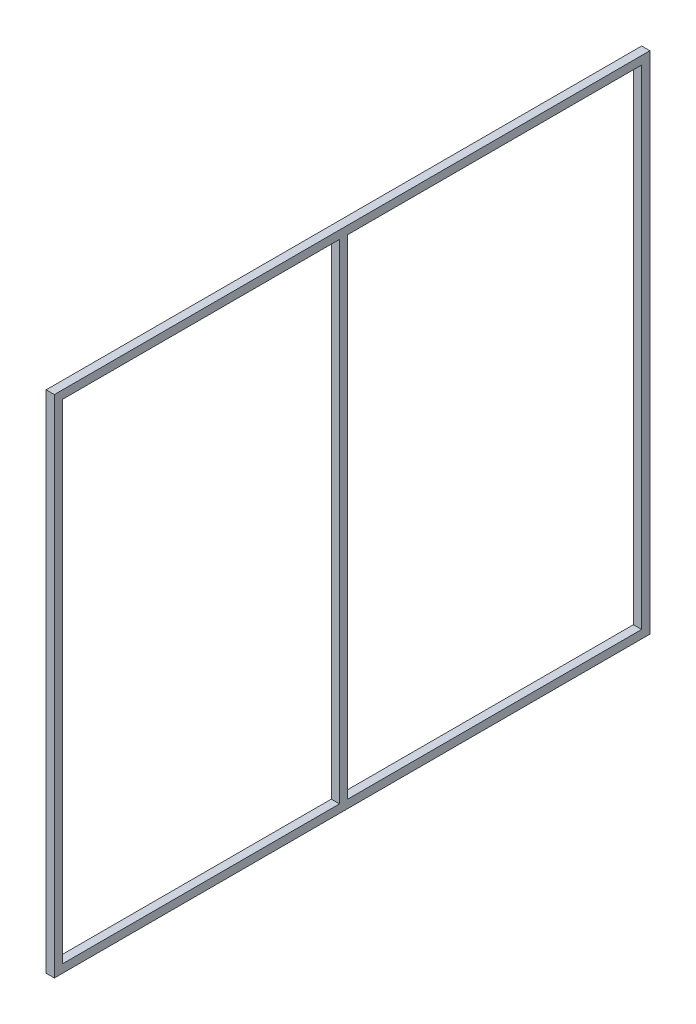
ISO-10303-21;
HEADER;
FILE_DESCRIPTION(('STEP AP214'),'2;1');
FILE_NAME('part.step','',(''),(''),'','','');
FILE_SCHEMA(('AUTOMOTIVE_DESIGN { 1 0 10303 214 1 1 1 1 }'));
ENDSEC;
DATA;
#1=APPLICATION_CONTEXT('core data for automotive mechanical design processes');
#2=APPLICATION_PROTOCOL_DEFINITION('international standard','automotive_design',2000,#1);
#3=PRODUCT_CONTEXT('',#1,'mechanical');
#4=PRODUCT('Part','Part','',(#3));
#5=PRODUCT_RELATED_PRODUCT_CATEGORY('part','',(#4));
#6=PRODUCT_DEFINITION_FORMATION('','',#4);
#7=PRODUCT_DEFINITION_CONTEXT('part definition',#1,'design');
#8=PRODUCT_DEFINITION('design','',#6,#7);
#9=PRODUCT_DEFINITION_SHAPE('','',#8);
#10=(LENGTH_UNIT() NAMED_UNIT(*) SI_UNIT(.MILLI.,.METRE.));
#11=(NAMED_UNIT(*) PLANE_ANGLE_UNIT() SI_UNIT($,.RADIAN.));
#12=(NAMED_UNIT(*) SI_UNIT($,.STERADIAN.) SOLID_ANGLE_UNIT());
#13=UNCERTAINTY_MEASURE_WITH_UNIT(LENGTH_MEASURE(1.E-05),#10,'distance_accuracy_value','');
#14=(GEOMETRIC_REPRESENTATION_CONTEXT(3) GLOBAL_UNCERTAINTY_ASSIGNED_CONTEXT((#13)) GLOBAL_UNIT_ASSIGNED_CONTEXT((#10,
#11,#12)) REPRESENTATION_CONTEXT('',''));
#15=CARTESIAN_POINT('',(0.,0.,0.));
#16=DIRECTION('',(0.,0.,1.));
#17=DIRECTION('',(1.,0.,0.));
#18=AXIS2_PLACEMENT_3D('',#15,#16,#17);
#19=CARTESIAN_POINT('',(15.875,-472.0175,-559.125));
#20=DIRECTION('',(0.,1.,0.));
#21=DIRECTION('',(0.,0.,-1.));
#22=AXIS2_PLACEMENT_3D('',#19,#20,#21);
#23=PLANE('',#22);
#24=DIRECTION('',(0.,0.,1.));
#25=VECTOR('',#24,1.);
#26=CARTESIAN_POINT('',(15.875,-472.0175,-559.125));
#27=LINE('',#26,#25);
#28=CARTESIAN_POINT('',(15.875,-472.0175,-559.125));
#29=VERTEX_POINT('',#28);
#30=CARTESIAN_POINT('',(15.875,-472.0175,8.43750000000501));
#31=VERTEX_POINT('',#30);
#32=EDGE_CURVE('E147',#29,#31,#27,.T.);
#33=ORIENTED_EDGE('',*,*,#32,.F.);
#34=DIRECTION('',(-1.,0.,0.));
#35=VECTOR('',#34,1.);
#36=CARTESIAN_POINT('',(15.875,-472.0175,-559.125));
#37=LINE('',#36,#35);
#38=CARTESIAN_POINT('',(0.,-472.0175,-559.125));
#39=VERTEX_POINT('',#38);
#40=EDGE_CURVE('E163',#29,#39,#37,.T.);
#41=ORIENTED_EDGE('',*,*,#40,.T.);
#42=DIRECTION('',(0.,0.,1.));
#43=VECTOR('',#42,1.);
#44=CARTESIAN_POINT('',(0.,-472.0175,-559.125));
#45=LINE('',#44,#43);
#46=CARTESIAN_POINT('',(0.,-472.0175,8.43750000000498));
#47=VERTEX_POINT('',#46);
#48=EDGE_CURVE('E164',#39,#47,#45,.T.);
#49=ORIENTED_EDGE('',*,*,#48,.T.);
#50=DIRECTION('',(1.,0.,0.));
#51=VECTOR('',#50,1.);
#52=CARTESIAN_POINT('',(15.875,-472.0175,8.43750000000501));
#53=LINE('',#52,#51);
#54=EDGE_CURVE('E142',#47,#31,#53,.T.);
#55=ORIENTED_EDGE('',*,*,#54,.T.);
#56=EDGE_LOOP('',(#33,#41,#49,#55));
#57=FACE_BOUND('',#56,.T.);
#58=ADVANCED_FACE('F35',(#57),#23,.T.);
#59=CARTESIAN_POINT('',(0.,-472.0175,24.312500000005));
#60=VERTEX_POINT('',#59);
#61=CARTESIAN_POINT('',(0.,-472.0175,559.125));
#62=VERTEX_POINT('',#61);
#63=EDGE_CURVE('E168',#60,#62,#45,.T.);
#64=ORIENTED_EDGE('',*,*,#63,.T.);
#65=DIRECTION('',(-1.,0.,0.));
#66=VECTOR('',#65,1.);
#67=CARTESIAN_POINT('',(15.875,-472.0175,559.125));
#68=LINE('',#67,#66);
#69=CARTESIAN_POINT('',(15.875,-472.0175,559.125));
#70=VERTEX_POINT('',#69);
#71=EDGE_CURVE('E146',#70,#62,#68,.T.);
#72=ORIENTED_EDGE('',*,*,#71,.F.);
#73=CARTESIAN_POINT('',(15.875,-472.0175,24.3125000000051));
#74=VERTEX_POINT('',#73);
#75=EDGE_CURVE('E129',#74,#70,#27,.T.);
#76=ORIENTED_EDGE('',*,*,#75,.F.);
#77=DIRECTION('',(-1.,0.,0.));
#78=VECTOR('',#77,1.);
#79=CARTESIAN_POINT('',(15.875,-472.0175,24.3125000000051));
#80=LINE('',#79,#78);
#81=EDGE_CURVE('E136',#74,#60,#80,.T.);
#82=ORIENTED_EDGE('',*,*,#81,.T.);
#83=EDGE_LOOP('',(#64,#72,#76,#82));
#84=FACE_BOUND('',#83,.T.);
#85=ADVANCED_FACE('F144',(#84),#23,.T.);
#86=CARTESIAN_POINT('',(15.875,472.0175,-559.125));
#87=DIRECTION('',(0.,-1.,0.));
#88=DIRECTION('',(0.,0.,1.));
#89=AXIS2_PLACEMENT_3D('',#86,#87,#88);
#90=PLANE('',#89);
#91=DIRECTION('',(0.,0.,-1.));
#92=VECTOR('',#91,1.);
#93=CARTESIAN_POINT('',(0.,472.0175,-559.125));
#94=LINE('',#93,#92);
#95=CARTESIAN_POINT('',(0.,472.0175,8.43750000000498));
#96=VERTEX_POINT('',#95);
#97=CARTESIAN_POINT('',(0.,472.0175,-559.125));
#98=VERTEX_POINT('',#97);
#99=EDGE_CURVE('E170',#96,#98,#94,.T.);
#100=ORIENTED_EDGE('',*,*,#99,.T.);
#101=DIRECTION('',(-1.,0.,0.));
#102=VECTOR('',#101,1.);
#103=CARTESIAN_POINT('',(15.875,472.0175,-559.125));
#104=LINE('',#103,#102);
#105=CARTESIAN_POINT('',(15.875,472.0175,-559.125));
#106=VERTEX_POINT('',#105);
#107=EDGE_CURVE('E175',#106,#98,#104,.T.);
#108=ORIENTED_EDGE('',*,*,#107,.F.);
#109=DIRECTION('',(0.,0.,-1.));
#110=VECTOR('',#109,1.);
#111=CARTESIAN_POINT('',(15.875,472.0175,-559.125));
#112=LINE('',#111,#110);
#113=CARTESIAN_POINT('',(15.875,472.0175,8.43750000000501));
#114=VERTEX_POINT('',#113);
#115=EDGE_CURVE('E159',#114,#106,#112,.T.);
#116=ORIENTED_EDGE('',*,*,#115,.F.);
#117=DIRECTION('',(-1.,0.,0.));
#118=VECTOR('',#117,1.);
#119=CARTESIAN_POINT('',(15.875,472.0175,8.43750000000501));
#120=LINE('',#119,#118);
#121=EDGE_CURVE('E134',#114,#96,#120,.T.);
#122=ORIENTED_EDGE('',*,*,#121,.T.);
#123=EDGE_LOOP('',(#100,#108,#116,#122));
#124=FACE_BOUND('',#123,.T.);
#125=ADVANCED_FACE('F246',(#124),#90,.T.);
#126=CARTESIAN_POINT('',(15.875,472.0175,559.125));
#127=VERTEX_POINT('',#126);
#128=CARTESIAN_POINT('',(15.875,472.0175,24.3125000000051));
#129=VERTEX_POINT('',#128);
#130=EDGE_CURVE('E132',#127,#129,#112,.T.);
#131=ORIENTED_EDGE('',*,*,#130,.F.);
#132=DIRECTION('',(-1.,0.,0.));
#133=VECTOR('',#132,1.);
#134=CARTESIAN_POINT('',(15.875,472.0175,559.125));
#135=LINE('',#134,#133);
#136=CARTESIAN_POINT('',(0.,472.0175,559.125));
#137=VERTEX_POINT('',#136);
#138=EDGE_CURVE('E178',#127,#137,#135,.T.);
#139=ORIENTED_EDGE('',*,*,#138,.T.);
#140=CARTESIAN_POINT('',(0.,472.0175,24.312500000005));
#141=VERTEX_POINT('',#140);
#142=EDGE_CURVE('E152',#137,#141,#94,.T.);
#143=ORIENTED_EDGE('',*,*,#142,.T.);
#144=DIRECTION('',(1.,0.,0.));
#145=VECTOR('',#144,1.);
#146=CARTESIAN_POINT('',(15.875,472.0175,24.3125000000051));
#147=LINE('',#146,#145);
#148=EDGE_CURVE('E156',#141,#129,#147,.T.);
#149=ORIENTED_EDGE('',*,*,#148,.T.);
#150=EDGE_LOOP('',(#131,#139,#143,#149));
#151=FACE_BOUND('',#150,.T.);
#152=ADVANCED_FACE('F251',(#151),#90,.T.);
#153=CARTESIAN_POINT('',(15.875,0.,0.));
#154=DIRECTION('',(-1.,0.,0.));
#155=DIRECTION('',(0.,0.,-1.));
#156=AXIS2_PLACEMENT_3D('',#153,#154,#155);
#157=PLANE('',#156);
#158=ORIENTED_EDGE('',*,*,#75,.T.);
#159=DIRECTION('',(0.,1.,0.));
#160=VECTOR('',#159,1.);
#161=CARTESIAN_POINT('',(15.875,-472.0175,559.125));
#162=LINE('',#161,#160);
#163=EDGE_CURVE('E151',#70,#127,#162,.T.);
#164=ORIENTED_EDGE('',*,*,#163,.T.);
#165=ORIENTED_EDGE('',*,*,#130,.T.);
#166=DIRECTION('',(0.,-1.,0.));
#167=VECTOR('',#166,1.);
#168=CARTESIAN_POINT('',(15.875,487.8945,24.3125000000051));
#169=LINE('',#168,#167);
#170=EDGE_CURVE('E125',#129,#74,#169,.T.);
#171=ORIENTED_EDGE('',*,*,#170,.T.);
#172=EDGE_LOOP('',(#158,#164,#165,#171));
#173=FACE_BOUND('',#172,.T.);
#174=DIRECTION('',(0.,1.,0.));
#175=VECTOR('',#174,1.);
#176=CARTESIAN_POINT('',(15.875,-487.8925,575.));
#177=LINE('',#176,#175);
#178=CARTESIAN_POINT('',(15.875,-487.8925,575.));
#179=VERTEX_POINT('',#178);
#180=CARTESIAN_POINT('',(15.875,487.8925,575.));
#181=VERTEX_POINT('',#180);
#182=EDGE_CURVE('E183',#179,#181,#177,.T.);
#183=ORIENTED_EDGE('',*,*,#182,.F.);
#184=DIRECTION('',(0.,0.,1.));
#185=VECTOR('',#184,1.);
#186=CARTESIAN_POINT('',(15.875,-487.8925,-575.));
#187=LINE('',#186,#185);
#188=CARTESIAN_POINT('',(15.875,-487.8925,-575.));
#189=VERTEX_POINT('',#188);
#190=EDGE_CURVE('E193',#189,#179,#187,.T.);
#191=ORIENTED_EDGE('',*,*,#190,.F.);
#192=DIRECTION('',(0.,-1.,0.));
#193=VECTOR('',#192,1.);
#194=CARTESIAN_POINT('',(15.875,-487.8925,-575.));
#195=LINE('',#194,#193);
#196=CARTESIAN_POINT('',(15.875,487.8925,-575.));
#197=VERTEX_POINT('',#196);
#198=EDGE_CURVE('E190',#197,#189,#195,.T.);
#199=ORIENTED_EDGE('',*,*,#198,.F.);
#200=DIRECTION('',(0.,0.,-1.));
#201=VECTOR('',#200,1.);
#202=CARTESIAN_POINT('',(15.875,487.8925,-575.));
#203=LINE('',#202,#201);
#204=EDGE_CURVE('E186',#181,#197,#203,.T.);
#205=ORIENTED_EDGE('',*,*,#204,.F.);
#206=EDGE_LOOP('',(#183,#191,#199,#205));
#207=FACE_BOUND('',#206,.T.);
#208=ORIENTED_EDGE('',*,*,#32,.T.);
#209=DIRECTION('',(0.,-1.,0.));
#210=VECTOR('',#209,1.);
#211=CARTESIAN_POINT('',(15.875,487.8945,8.43750000000501));
#212=LINE('',#211,#210);
#213=EDGE_CURVE('E141',#114,#31,#212,.T.);
#214=ORIENTED_EDGE('',*,*,#213,.F.);
#215=ORIENTED_EDGE('',*,*,#115,.T.);
#216=DIRECTION('',(0.,-1.,0.));
#217=VECTOR('',#216,1.);
#218=CARTESIAN_POINT('',(15.875,-472.0175,-559.125));
#219=LINE('',#218,#217);
#220=EDGE_CURVE('E161',#106,#29,#219,.T.);
#221=ORIENTED_EDGE('',*,*,#220,.T.);
#222=EDGE_LOOP('',(#208,#214,#215,#221));
#223=FACE_BOUND('',#222,.T.);
#224=ADVANCED_FACE('F126',(#173,#207,#223),#157,.F.);
#225=CARTESIAN_POINT('',(0.,0.,0.));
#226=DIRECTION('',(-1.,0.,0.));
#227=DIRECTION('',(0.,0.,-1.));
#228=AXIS2_PLACEMENT_3D('',#225,#226,#227);
#229=PLANE('',#228);
#230=ORIENTED_EDGE('',*,*,#48,.F.);
#231=DIRECTION('',(0.,-1.,0.));
#232=VECTOR('',#231,1.);
#233=CARTESIAN_POINT('',(0.,-472.0175,-559.125));
#234=LINE('',#233,#232);
#235=EDGE_CURVE('E148',#98,#39,#234,.T.);
#236=ORIENTED_EDGE('',*,*,#235,.F.);
#237=ORIENTED_EDGE('',*,*,#99,.F.);
#238=DIRECTION('',(0.,-1.,0.));
#239=VECTOR('',#238,1.);
#240=CARTESIAN_POINT('',(0.,487.8945,8.43750000000498));
#241=LINE('',#240,#239);
#242=EDGE_CURVE('E58',#96,#47,#241,.T.);
#243=ORIENTED_EDGE('',*,*,#242,.T.);
#244=EDGE_LOOP('',(#230,#236,#237,#243));
#245=FACE_BOUND('',#244,.T.);
#246=DIRECTION('',(0.,1.,0.));
#247=VECTOR('',#246,1.);
#248=CARTESIAN_POINT('',(0.,-487.8925,575.));
#249=LINE('',#248,#247);
#250=CARTESIAN_POINT('',(0.,-487.8925,575.));
#251=VERTEX_POINT('',#250);
#252=CARTESIAN_POINT('',(0.,487.8925,575.));
#253=VERTEX_POINT('',#252);
#254=EDGE_CURVE('E182',#251,#253,#249,.T.);
#255=ORIENTED_EDGE('',*,*,#254,.T.);
#256=DIRECTION('',(0.,0.,-1.));
#257=VECTOR('',#256,1.);
#258=CARTESIAN_POINT('',(0.,487.8925,-575.));
#259=LINE('',#258,#257);
#260=CARTESIAN_POINT('',(0.,487.8925,-575.));
#261=VERTEX_POINT('',#260);
#262=EDGE_CURVE('E199',#253,#261,#259,.T.);
#263=ORIENTED_EDGE('',*,*,#262,.T.);
#264=DIRECTION('',(0.,-1.,0.));
#265=VECTOR('',#264,1.);
#266=CARTESIAN_POINT('',(0.,-487.8925,-575.));
#267=LINE('',#266,#265);
#268=CARTESIAN_POINT('',(0.,-487.8925,-575.));
#269=VERTEX_POINT('',#268);
#270=EDGE_CURVE('E202',#261,#269,#267,.T.);
#271=ORIENTED_EDGE('',*,*,#270,.T.);
#272=DIRECTION('',(0.,0.,1.));
#273=VECTOR('',#272,1.);
#274=CARTESIAN_POINT('',(0.,-487.8925,559.125));
#275=LINE('',#274,#273);
#276=EDGE_CURVE('E187',#269,#251,#275,.T.);
#277=ORIENTED_EDGE('',*,*,#276,.T.);
#278=EDGE_LOOP('',(#255,#263,#271,#277));
#279=FACE_BOUND('',#278,.T.);
#280=DIRECTION('',(0.,-1.,0.));
#281=VECTOR('',#280,1.);
#282=CARTESIAN_POINT('',(0.,487.8945,24.312500000005));
#283=LINE('',#282,#281);
#284=EDGE_CURVE('E50',#141,#60,#283,.T.);
#285=ORIENTED_EDGE('',*,*,#284,.F.);
#286=ORIENTED_EDGE('',*,*,#142,.F.);
#287=DIRECTION('',(0.,1.,0.));
#288=VECTOR('',#287,1.);
#289=CARTESIAN_POINT('',(0.,-472.0175,559.125));
#290=LINE('',#289,#288);
#291=EDGE_CURVE('E167',#62,#137,#290,.T.);
#292=ORIENTED_EDGE('',*,*,#291,.F.);
#293=ORIENTED_EDGE('',*,*,#63,.F.);
#294=EDGE_LOOP('',(#285,#286,#292,#293));
#295=FACE_BOUND('',#294,.T.);
#296=ADVANCED_FACE('F219',(#245,#279,#295),#229,.T.);
#297=CARTESIAN_POINT('',(15.875,-487.8925,575.));
#298=DIRECTION('',(0.,0.,-1.));
#299=DIRECTION('',(1.,0.,0.));
#300=AXIS2_PLACEMENT_3D('',#297,#298,#299);
#301=PLANE('',#300);
#302=ORIENTED_EDGE('',*,*,#254,.F.);
#303=DIRECTION('',(-1.,0.,0.));
#304=VECTOR('',#303,1.);
#305=CARTESIAN_POINT('',(15.875,-487.8925,575.));
#306=LINE('',#305,#304);
#307=EDGE_CURVE('E196',#179,#251,#306,.T.);
#308=ORIENTED_EDGE('',*,*,#307,.F.);
#309=ORIENTED_EDGE('',*,*,#182,.T.);
#310=DIRECTION('',(-1.,0.,0.));
#311=VECTOR('',#310,1.);
#312=CARTESIAN_POINT('',(15.875,487.8925,575.));
#313=LINE('',#312,#311);
#314=EDGE_CURVE('E11',#181,#253,#313,.T.);
#315=ORIENTED_EDGE('',*,*,#314,.T.);
#316=EDGE_LOOP('',(#302,#308,#309,#315));
#317=FACE_BOUND('',#316,.T.);
#318=ADVANCED_FACE('F37',(#317),#301,.F.);
#319=CARTESIAN_POINT('',(15.875,487.8925,-575.));
#320=DIRECTION('',(0.,-1.,0.));
#321=DIRECTION('',(0.,0.,1.));
#322=AXIS2_PLACEMENT_3D('',#319,#320,#321);
#323=PLANE('',#322);
#324=ORIENTED_EDGE('',*,*,#262,.F.);
#325=ORIENTED_EDGE('',*,*,#314,.F.);
#326=ORIENTED_EDGE('',*,*,#204,.T.);
#327=DIRECTION('',(-1.,0.,0.));
#328=VECTOR('',#327,1.);
#329=CARTESIAN_POINT('',(15.875,487.8925,-575.));
#330=LINE('',#329,#328);
#331=EDGE_CURVE('E43',#197,#261,#330,.T.);
#332=ORIENTED_EDGE('',*,*,#331,.T.);
#333=EDGE_LOOP('',(#324,#325,#326,#332));
#334=FACE_BOUND('',#333,.T.);
#335=ADVANCED_FACE('F212',(#334),#323,.F.);
#336=CARTESIAN_POINT('',(15.875,-487.8925,-575.));
#337=DIRECTION('',(0.,0.,1.));
#338=DIRECTION('',(-1.,0.,0.));
#339=AXIS2_PLACEMENT_3D('',#336,#337,#338);
#340=PLANE('',#339);
#341=ORIENTED_EDGE('',*,*,#270,.F.);
#342=ORIENTED_EDGE('',*,*,#331,.F.);
#343=ORIENTED_EDGE('',*,*,#198,.T.);
#344=DIRECTION('',(-1.,0.,0.));
#345=VECTOR('',#344,1.);
#346=CARTESIAN_POINT('',(15.875,-487.8925,-575.));
#347=LINE('',#346,#345);
#348=EDGE_CURVE('E208',#189,#269,#347,.T.);
#349=ORIENTED_EDGE('',*,*,#348,.T.);
#350=EDGE_LOOP('',(#341,#342,#343,#349));
#351=FACE_BOUND('',#350,.T.);
#352=ADVANCED_FACE('F216',(#351),#340,.F.);
#353=CARTESIAN_POINT('',(15.875,-487.8925,559.125));
#354=DIRECTION('',(0.,1.,0.));
#355=DIRECTION('',(0.,0.,-1.));
#356=AXIS2_PLACEMENT_3D('',#353,#354,#355);
#357=PLANE('',#356);
#358=ORIENTED_EDGE('',*,*,#276,.F.);
#359=ORIENTED_EDGE('',*,*,#348,.F.);
#360=ORIENTED_EDGE('',*,*,#190,.T.);
#361=ORIENTED_EDGE('',*,*,#307,.T.);
#362=EDGE_LOOP('',(#358,#359,#360,#361));
#363=FACE_BOUND('',#362,.T.);
#364=ADVANCED_FACE('F227',(#363),#357,.F.);
#365=CARTESIAN_POINT('',(15.875,-472.0175,559.125));
#366=DIRECTION('',(0.,0.,-1.));
#367=DIRECTION('',(1.,0.,0.));
#368=AXIS2_PLACEMENT_3D('',#365,#366,#367);
#369=PLANE('',#368);
#370=ORIENTED_EDGE('',*,*,#291,.T.);
#371=ORIENTED_EDGE('',*,*,#138,.F.);
#372=ORIENTED_EDGE('',*,*,#163,.F.);
#373=ORIENTED_EDGE('',*,*,#71,.T.);
#374=EDGE_LOOP('',(#370,#371,#372,#373));
#375=FACE_BOUND('',#374,.T.);
#376=ADVANCED_FACE('F229',(#375),#369,.T.);
#377=CARTESIAN_POINT('',(15.875,-472.0175,-559.125));
#378=DIRECTION('',(0.,0.,1.));
#379=DIRECTION('',(0.,1.,0.));
#380=AXIS2_PLACEMENT_3D('',#377,#378,#379);
#381=PLANE('',#380);
#382=ORIENTED_EDGE('',*,*,#235,.T.);
#383=ORIENTED_EDGE('',*,*,#40,.F.);
#384=ORIENTED_EDGE('',*,*,#220,.F.);
#385=ORIENTED_EDGE('',*,*,#107,.T.);
#386=EDGE_LOOP('',(#382,#383,#384,#385));
#387=FACE_BOUND('',#386,.T.);
#388=ADVANCED_FACE('F235',(#387),#381,.T.);
#389=CARTESIAN_POINT('',(15.875,487.8945,8.43750000000501));
#390=DIRECTION('',(0.,0.,1.));
#391=DIRECTION('',(-1.,0.,0.));
#392=AXIS2_PLACEMENT_3D('',#389,#390,#391);
#393=PLANE('',#392);
#394=ORIENTED_EDGE('',*,*,#213,.T.);
#395=ORIENTED_EDGE('',*,*,#54,.F.);
#396=ORIENTED_EDGE('',*,*,#242,.F.);
#397=ORIENTED_EDGE('',*,*,#121,.F.);
#398=EDGE_LOOP('',(#394,#395,#396,#397));
#399=FACE_BOUND('',#398,.T.);
#400=ADVANCED_FACE('F271',(#399),#393,.F.);
#401=CARTESIAN_POINT('',(15.875,487.8945,24.3125000000051));
#402=DIRECTION('',(0.,0.,-1.));
#403=DIRECTION('',(1.,0.,0.));
#404=AXIS2_PLACEMENT_3D('',#401,#402,#403);
#405=PLANE('',#404);
#406=ORIENTED_EDGE('',*,*,#284,.T.);
#407=ORIENTED_EDGE('',*,*,#81,.F.);
#408=ORIENTED_EDGE('',*,*,#170,.F.);
#409=ORIENTED_EDGE('',*,*,#148,.F.);
#410=EDGE_LOOP('',(#406,#407,#408,#409));
#411=FACE_BOUND('',#410,.T.);
#412=ADVANCED_FACE('F137',(#411),#405,.F.);
#413=CLOSED_SHELL('',(#58,#85,#125,#152,#224,#296,#318,#335,#352,#364,#376,#388,#400,#412));
#414=MANIFOLD_SOLID_BREP('B2',#413);
#415=ADVANCED_BREP_SHAPE_REPRESENTATION('',(#18,#414),#14);
#416=SHAPE_DEFINITION_REPRESENTATION(#9,#415);
ENDSEC;
END-ISO-10303-21;
